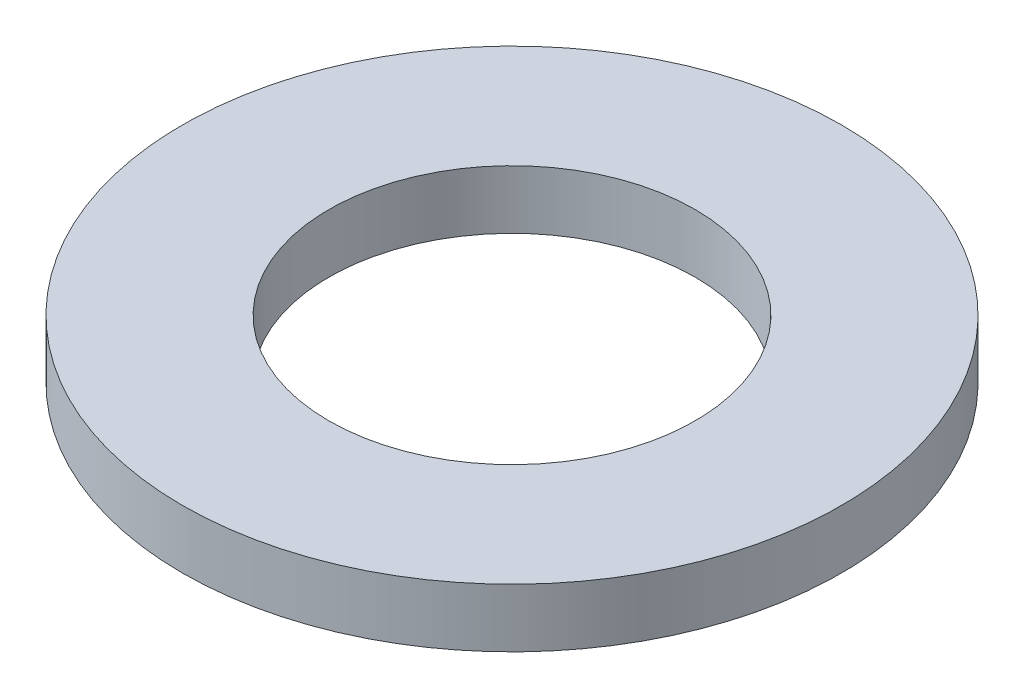
ISO-10303-21;
HEADER;
FILE_DESCRIPTION(('STEP AP214'),'2;1');
FILE_NAME('part.step','',(''),(''),'','','');
FILE_SCHEMA(('AUTOMOTIVE_DESIGN { 1 0 10303 214 1 1 1 1 }'));
ENDSEC;
DATA;
#1=APPLICATION_CONTEXT('core data for automotive mechanical design processes');
#2=APPLICATION_PROTOCOL_DEFINITION('international standard','automotive_design',2000,#1);
#3=PRODUCT_CONTEXT('',#1,'mechanical');
#4=PRODUCT('Part','Part','',(#3));
#5=PRODUCT_RELATED_PRODUCT_CATEGORY('part','',(#4));
#6=PRODUCT_DEFINITION_FORMATION('','',#4);
#7=PRODUCT_DEFINITION_CONTEXT('part definition',#1,'design');
#8=PRODUCT_DEFINITION('design','',#6,#7);
#9=PRODUCT_DEFINITION_SHAPE('','',#8);
#10=(LENGTH_UNIT() NAMED_UNIT(*) SI_UNIT(.MILLI.,.METRE.));
#11=(NAMED_UNIT(*) PLANE_ANGLE_UNIT() SI_UNIT($,.RADIAN.));
#12=(NAMED_UNIT(*) SI_UNIT($,.STERADIAN.) SOLID_ANGLE_UNIT());
#13=UNCERTAINTY_MEASURE_WITH_UNIT(LENGTH_MEASURE(1.E-05),#10,'distance_accuracy_value','');
#14=(GEOMETRIC_REPRESENTATION_CONTEXT(3) GLOBAL_UNCERTAINTY_ASSIGNED_CONTEXT((#13)) GLOBAL_UNIT_ASSIGNED_CONTEXT((#10,
#11,#12)) REPRESENTATION_CONTEXT('',''));
#15=CARTESIAN_POINT('',(0.,0.,0.));
#16=DIRECTION('',(0.,0.,1.));
#17=DIRECTION('',(1.,0.,0.));
#18=AXIS2_PLACEMENT_3D('',#15,#16,#17);
#19=CARTESIAN_POINT('',(0.,12.,0.));
#20=DIRECTION('',(0.,-1.,0.));
#21=DIRECTION('',(0.,0.,-1.));
#22=AXIS2_PLACEMENT_3D('',#19,#20,#21);
#23=CYLINDRICAL_SURFACE('',#22,67.5);
#24=CARTESIAN_POINT('',(0.,12.,0.));
#25=DIRECTION('',(0.,1.,0.));
#26=DIRECTION('',(0.,0.,1.));
#27=AXIS2_PLACEMENT_3D('',#24,#25,#26);
#28=CIRCLE('',#27,67.5);
#29=CARTESIAN_POINT('',(0.,12.,67.5));
#30=VERTEX_POINT('',#29);
#31=EDGE_CURVE('E10',#30,#30,#28,.T.);
#32=ORIENTED_EDGE('',*,*,#31,.F.);
#33=EDGE_LOOP('',(#32));
#34=FACE_BOUND('',#33,.T.);
#35=CARTESIAN_POINT('',(0.,0.,0.));
#36=DIRECTION('',(0.,1.,0.));
#37=DIRECTION('',(0.,0.,1.));
#38=AXIS2_PLACEMENT_3D('',#35,#36,#37);
#39=CIRCLE('',#38,67.5);
#40=CARTESIAN_POINT('',(0.,0.,67.5));
#41=VERTEX_POINT('',#40);
#42=EDGE_CURVE('E37',#41,#41,#39,.T.);
#43=ORIENTED_EDGE('',*,*,#42,.T.);
#44=EDGE_LOOP('',(#43));
#45=FACE_BOUND('',#44,.T.);
#46=ADVANCED_FACE('F40',(#34,#45),#23,.T.);
#47=CARTESIAN_POINT('',(0.,12.,0.));
#48=DIRECTION('',(0.,1.,0.));
#49=DIRECTION('',(0.,0.,1.));
#50=AXIS2_PLACEMENT_3D('',#47,#48,#49);
#51=PLANE('',#50);
#52=CARTESIAN_POINT('',(0.,12.,0.));
#53=DIRECTION('',(0.,1.,0.));
#54=DIRECTION('',(0.,0.,1.));
#55=AXIS2_PLACEMENT_3D('',#52,#53,#54);
#56=CIRCLE('',#55,37.5);
#57=CARTESIAN_POINT('',(0.,12.,37.5));
#58=VERTEX_POINT('',#57);
#59=EDGE_CURVE('E50',#58,#58,#56,.T.);
#60=ORIENTED_EDGE('',*,*,#59,.F.);
#61=EDGE_LOOP('',(#60));
#62=FACE_BOUND('',#61,.T.);
#63=ORIENTED_EDGE('',*,*,#31,.T.);
#64=EDGE_LOOP('',(#63));
#65=FACE_BOUND('',#64,.T.);
#66=ADVANCED_FACE('F59',(#62,#65),#51,.T.);
#67=CARTESIAN_POINT('',(0.,0.,0.));
#68=DIRECTION('',(0.,1.,0.));
#69=DIRECTION('',(0.,0.,1.));
#70=AXIS2_PLACEMENT_3D('',#67,#68,#69);
#71=PLANE('',#70);
#72=CARTESIAN_POINT('',(0.,0.,0.));
#73=DIRECTION('',(0.,1.,0.));
#74=DIRECTION('',(0.,0.,1.));
#75=AXIS2_PLACEMENT_3D('',#72,#73,#74);
#76=CIRCLE('',#75,37.5);
#77=CARTESIAN_POINT('',(0.,0.,37.5));
#78=VERTEX_POINT('',#77);
#79=EDGE_CURVE('E47',#78,#78,#76,.T.);
#80=ORIENTED_EDGE('',*,*,#79,.T.);
#81=EDGE_LOOP('',(#80));
#82=FACE_BOUND('',#81,.T.);
#83=ORIENTED_EDGE('',*,*,#42,.F.);
#84=EDGE_LOOP('',(#83));
#85=FACE_BOUND('',#84,.T.);
#86=ADVANCED_FACE('F58',(#82,#85),#71,.F.);
#87=CARTESIAN_POINT('',(0.,12.,0.));
#88=DIRECTION('',(0.,-1.,0.));
#89=DIRECTION('',(0.,0.,-1.));
#90=AXIS2_PLACEMENT_3D('',#87,#88,#89);
#91=CYLINDRICAL_SURFACE('',#90,37.5);
#92=ORIENTED_EDGE('',*,*,#59,.T.);
#93=EDGE_LOOP('',(#92));
#94=FACE_BOUND('',#93,.T.);
#95=ORIENTED_EDGE('',*,*,#79,.F.);
#96=EDGE_LOOP('',(#95));
#97=FACE_BOUND('',#96,.T.);
#98=ADVANCED_FACE('F54',(#94,#97),#91,.F.);
#99=CLOSED_SHELL('',(#46,#66,#86,#98));
#100=MANIFOLD_SOLID_BREP('B2',#99);
#101=ADVANCED_BREP_SHAPE_REPRESENTATION('',(#18,#100),#14);
#102=SHAPE_DEFINITION_REPRESENTATION(#9,#101);
ENDSEC;
END-ISO-10303-21;
